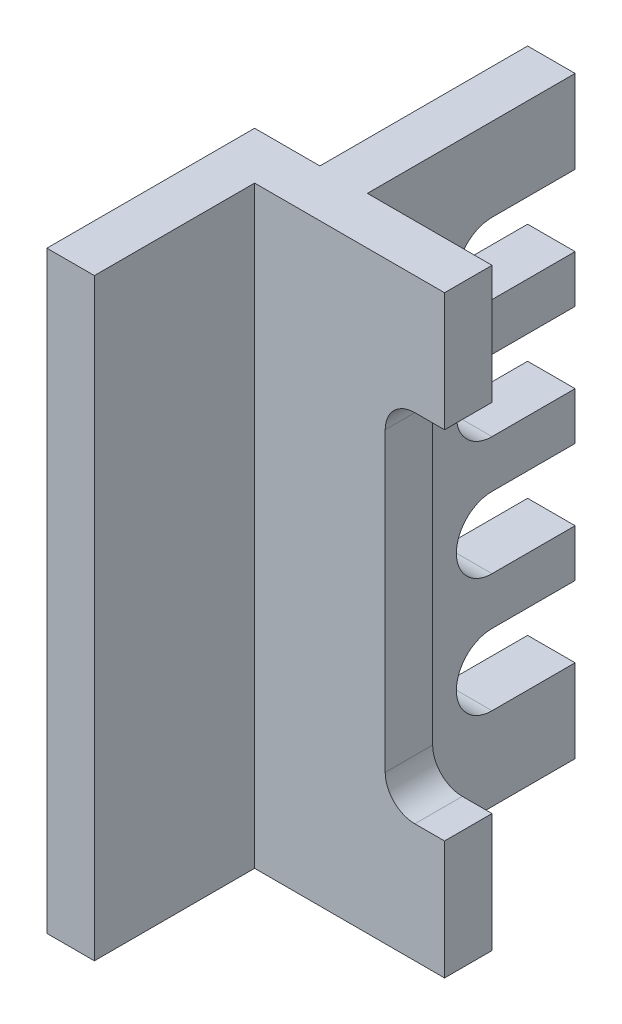
ISO-10303-21;
HEADER;
FILE_DESCRIPTION(('STEP AP214'),'2;1');
FILE_NAME('part.step','',(''),(''),'','','');
FILE_SCHEMA(('AUTOMOTIVE_DESIGN { 1 0 10303 214 1 1 1 1 }'));
ENDSEC;
DATA;
#1=APPLICATION_CONTEXT('core data for automotive mechanical design processes');
#2=APPLICATION_PROTOCOL_DEFINITION('international standard','automotive_design',2000,#1);
#3=PRODUCT_CONTEXT('',#1,'mechanical');
#4=PRODUCT('Part','Part','',(#3));
#5=PRODUCT_RELATED_PRODUCT_CATEGORY('part','',(#4));
#6=PRODUCT_DEFINITION_FORMATION('','',#4);
#7=PRODUCT_DEFINITION_CONTEXT('part definition',#1,'design');
#8=PRODUCT_DEFINITION('design','',#6,#7);
#9=PRODUCT_DEFINITION_SHAPE('','',#8);
#10=(LENGTH_UNIT() NAMED_UNIT(*) SI_UNIT(.MILLI.,.METRE.));
#11=(NAMED_UNIT(*) PLANE_ANGLE_UNIT() SI_UNIT($,.RADIAN.));
#12=(NAMED_UNIT(*) SI_UNIT($,.STERADIAN.) SOLID_ANGLE_UNIT());
#13=UNCERTAINTY_MEASURE_WITH_UNIT(LENGTH_MEASURE(1.E-05),#10,'distance_accuracy_value','');
#14=(GEOMETRIC_REPRESENTATION_CONTEXT(3) GLOBAL_UNCERTAINTY_ASSIGNED_CONTEXT((#13)) GLOBAL_UNIT_ASSIGNED_CONTEXT((#10,
#11,#12)) REPRESENTATION_CONTEXT('',''));
#15=CARTESIAN_POINT('',(0.,0.,0.));
#16=DIRECTION('',(0.,0.,1.));
#17=DIRECTION('',(1.,0.,0.));
#18=AXIS2_PLACEMENT_3D('',#15,#16,#17);
#19=CARTESIAN_POINT('',(0.,0.,-70.));
#20=DIRECTION('',(0.,0.,-1.));
#21=DIRECTION('',(-1.,0.,0.));
#22=AXIS2_PLACEMENT_3D('',#19,#20,#21);
#23=PLANE('',#22);
#24=DIRECTION('',(1.,0.,0.));
#25=VECTOR('',#24,1.);
#26=CARTESIAN_POINT('',(11.,86.,-70.));
#27=LINE('',#26,#25);
#28=CARTESIAN_POINT('',(11.,86.,-70.));
#29=VERTEX_POINT('',#28);
#30=CARTESIAN_POINT('',(19.,86.,-70.));
#31=VERTEX_POINT('',#30);
#32=EDGE_CURVE('E293',#29,#31,#27,.T.);
#33=ORIENTED_EDGE('',*,*,#32,.F.);
#34=DIRECTION('',(0.,1.,0.));
#35=VECTOR('',#34,1.);
#36=CARTESIAN_POINT('',(11.,0.,-70.));
#37=LINE('',#36,#35);
#38=CARTESIAN_POINT('',(11.,100.,-70.));
#39=VERTEX_POINT('',#38);
#40=EDGE_CURVE('E415',#29,#39,#37,.T.);
#41=ORIENTED_EDGE('',*,*,#40,.T.);
#42=DIRECTION('',(1.,0.,0.));
#43=VECTOR('',#42,1.);
#44=CARTESIAN_POINT('',(11.,100.,-70.));
#45=LINE('',#44,#43);
#46=CARTESIAN_POINT('',(19.,100.,-70.));
#47=VERTEX_POINT('',#46);
#48=EDGE_CURVE('E401',#39,#47,#45,.T.);
#49=ORIENTED_EDGE('',*,*,#48,.T.);
#50=DIRECTION('',(0.,-1.,0.));
#51=VECTOR('',#50,1.);
#52=CARTESIAN_POINT('',(19.,100.,-70.));
#53=LINE('',#52,#51);
#54=EDGE_CURVE('E407',#47,#31,#53,.T.);
#55=ORIENTED_EDGE('',*,*,#54,.T.);
#56=EDGE_LOOP('',(#33,#41,#49,#55));
#57=FACE_BOUND('',#56,.T.);
#58=ADVANCED_FACE('F39',(#57),#23,.T.);
#59=DIRECTION('',(1.,0.,0.));
#60=VECTOR('',#59,1.);
#61=CARTESIAN_POINT('',(11.,74.,-70.));
#62=LINE('',#61,#60);
#63=CARTESIAN_POINT('',(11.,74.,-70.));
#64=VERTEX_POINT('',#63);
#65=CARTESIAN_POINT('',(19.,74.,-70.));
#66=VERTEX_POINT('',#65);
#67=EDGE_CURVE('E260',#64,#66,#62,.T.);
#68=ORIENTED_EDGE('',*,*,#67,.T.);
#69=CARTESIAN_POINT('',(19.,66.,-70.0000000000002));
#70=VERTEX_POINT('',#69);
#71=EDGE_CURVE('E412',#66,#70,#53,.T.);
#72=ORIENTED_EDGE('',*,*,#71,.T.);
#73=DIRECTION('',(1.,0.,0.));
#74=VECTOR('',#73,1.);
#75=CARTESIAN_POINT('',(11.,66.,-70.0000000000002));
#76=LINE('',#75,#74);
#77=CARTESIAN_POINT('',(11.,66.,-70.0000000000002));
#78=VERTEX_POINT('',#77);
#79=EDGE_CURVE('E325',#78,#70,#76,.T.);
#80=ORIENTED_EDGE('',*,*,#79,.F.);
#81=EDGE_CURVE('E612',#78,#64,#37,.T.);
#82=ORIENTED_EDGE('',*,*,#81,.T.);
#83=EDGE_LOOP('',(#68,#72,#80,#82));
#84=FACE_BOUND('',#83,.T.);
#85=ADVANCED_FACE('F649',(#84),#23,.T.);
#86=DIRECTION('',(1.,0.,0.));
#87=VECTOR('',#86,1.);
#88=CARTESIAN_POINT('',(11.,54.,-70.0000000000002));
#89=LINE('',#88,#87);
#90=CARTESIAN_POINT('',(11.,54.,-70.0000000000002));
#91=VERTEX_POINT('',#90);
#92=CARTESIAN_POINT('',(19.,54.,-70.));
#93=VERTEX_POINT('',#92);
#94=EDGE_CURVE('E328',#91,#93,#89,.T.);
#95=ORIENTED_EDGE('',*,*,#94,.T.);
#96=CARTESIAN_POINT('',(19.,46.,-70.0000000000004));
#97=VERTEX_POINT('',#96);
#98=EDGE_CURVE('E641',#93,#97,#53,.T.);
#99=ORIENTED_EDGE('',*,*,#98,.T.);
#100=DIRECTION('',(1.,0.,0.));
#101=VECTOR('',#100,1.);
#102=CARTESIAN_POINT('',(11.,46.,-70.0000000000004));
#103=LINE('',#102,#101);
#104=CARTESIAN_POINT('',(11.,46.,-70.0000000000004));
#105=VERTEX_POINT('',#104);
#106=EDGE_CURVE('E360',#105,#97,#103,.T.);
#107=ORIENTED_EDGE('',*,*,#106,.F.);
#108=EDGE_CURVE('E614',#105,#91,#37,.T.);
#109=ORIENTED_EDGE('',*,*,#108,.T.);
#110=EDGE_LOOP('',(#95,#99,#107,#109));
#111=FACE_BOUND('',#110,.T.);
#112=ADVANCED_FACE('F661',(#111),#23,.T.);
#113=DIRECTION('',(1.,0.,0.));
#114=VECTOR('',#113,1.);
#115=CARTESIAN_POINT('',(11.,34.,-70.0000000000004));
#116=LINE('',#115,#114);
#117=CARTESIAN_POINT('',(11.,34.,-70.0000000000004));
#118=VERTEX_POINT('',#117);
#119=CARTESIAN_POINT('',(19.,34.,-70.));
#120=VERTEX_POINT('',#119);
#121=EDGE_CURVE('E363',#118,#120,#116,.T.);
#122=ORIENTED_EDGE('',*,*,#121,.T.);
#123=CARTESIAN_POINT('',(19.,26.,-70.0000000000006));
#124=VERTEX_POINT('',#123);
#125=EDGE_CURVE('E638',#120,#124,#53,.T.);
#126=ORIENTED_EDGE('',*,*,#125,.T.);
#127=DIRECTION('',(1.,0.,0.));
#128=VECTOR('',#127,1.);
#129=CARTESIAN_POINT('',(11.,26.,-70.0000000000006));
#130=LINE('',#129,#128);
#131=CARTESIAN_POINT('',(11.,26.,-70.0000000000006));
#132=VERTEX_POINT('',#131);
#133=EDGE_CURVE('E393',#132,#124,#130,.T.);
#134=ORIENTED_EDGE('',*,*,#133,.F.);
#135=EDGE_CURVE('E421',#132,#118,#37,.T.);
#136=ORIENTED_EDGE('',*,*,#135,.T.);
#137=EDGE_LOOP('',(#122,#126,#134,#136));
#138=FACE_BOUND('',#137,.T.);
#139=ADVANCED_FACE('F627',(#138),#23,.T.);
#140=CARTESIAN_POINT('',(40.,100.,-35.));
#141=DIRECTION('',(0.,0.,1.));
#142=DIRECTION('',(1.,0.,0.));
#143=AXIS2_PLACEMENT_3D('',#140,#141,#142);
#144=PLANE('',#143);
#145=DIRECTION('',(0.,1.,0.));
#146=VECTOR('',#145,1.);
#147=CARTESIAN_POINT('',(11.,0.,-35.));
#148=LINE('',#147,#146);
#149=CARTESIAN_POINT('',(11.,0.,-35.));
#150=VERTEX_POINT('',#149);
#151=CARTESIAN_POINT('',(11.,100.,-35.));
#152=VERTEX_POINT('',#151);
#153=EDGE_CURVE('E406',#150,#152,#148,.T.);
#154=ORIENTED_EDGE('',*,*,#153,.F.);
#155=DIRECTION('',(-1.,0.,0.));
#156=VECTOR('',#155,1.);
#157=CARTESIAN_POINT('',(40.,0.,-35.));
#158=LINE('',#157,#156);
#159=CARTESIAN_POINT('',(0.,0.,-35.));
#160=VERTEX_POINT('',#159);
#161=EDGE_CURVE('E542',#150,#160,#158,.T.);
#162=ORIENTED_EDGE('',*,*,#161,.T.);
#163=DIRECTION('',(0.,-1.,0.));
#164=VECTOR('',#163,1.);
#165=CARTESIAN_POINT('',(0.,100.,-35.));
#166=LINE('',#165,#164);
#167=CARTESIAN_POINT('',(0.,100.,-35.));
#168=VERTEX_POINT('',#167);
#169=EDGE_CURVE('E524',#168,#160,#166,.T.);
#170=ORIENTED_EDGE('',*,*,#169,.F.);
#171=DIRECTION('',(-1.,0.,0.));
#172=VECTOR('',#171,1.);
#173=CARTESIAN_POINT('',(40.,100.,-35.));
#174=LINE('',#173,#172);
#175=EDGE_CURVE('E519',#152,#168,#174,.T.);
#176=ORIENTED_EDGE('',*,*,#175,.F.);
#177=EDGE_LOOP('',(#154,#162,#170,#176));
#178=FACE_BOUND('',#177,.T.);
#179=ADVANCED_FACE('F690',(#178),#144,.F.);
#180=DIRECTION('',(0.,-1.,0.));
#181=VECTOR('',#180,1.);
#182=CARTESIAN_POINT('',(19.,100.,-35.));
#183=LINE('',#182,#181);
#184=CARTESIAN_POINT('',(19.,100.,-35.));
#185=VERTEX_POINT('',#184);
#186=CARTESIAN_POINT('',(19.,0.,-35.));
#187=VERTEX_POINT('',#186);
#188=EDGE_CURVE('E292',#185,#187,#183,.T.);
#189=ORIENTED_EDGE('',*,*,#188,.F.);
#190=CARTESIAN_POINT('',(40.,100.,-35.));
#191=VERTEX_POINT('',#190);
#192=EDGE_CURVE('E520',#191,#185,#174,.T.);
#193=ORIENTED_EDGE('',*,*,#192,.F.);
#194=DIRECTION('',(0.,-1.,0.));
#195=VECTOR('',#194,1.);
#196=CARTESIAN_POINT('',(40.,100.,-35.));
#197=LINE('',#196,#195);
#198=CARTESIAN_POINT('',(40.,80.,-35.));
#199=VERTEX_POINT('',#198);
#200=EDGE_CURVE('E549',#191,#199,#197,.T.);
#201=ORIENTED_EDGE('',*,*,#200,.T.);
#202=DIRECTION('',(1.,0.,0.));
#203=VECTOR('',#202,1.);
#204=CARTESIAN_POINT('',(35.,80.,-35.));
#205=LINE('',#204,#203);
#206=CARTESIAN_POINT('',(35.,80.,-35.));
#207=VERTEX_POINT('',#206);
#208=EDGE_CURVE('E449',#207,#199,#205,.T.);
#209=ORIENTED_EDGE('',*,*,#208,.F.);
#210=CARTESIAN_POINT('',(35.,75.,-35.));
#211=DIRECTION('',(0.,0.,-1.));
#212=DIRECTION('',(1.,0.,0.));
#213=AXIS2_PLACEMENT_3D('',#210,#211,#212);
#214=CIRCLE('',#213,5.);
#215=CARTESIAN_POINT('',(30.,75.,-35.));
#216=VERTEX_POINT('',#215);
#217=EDGE_CURVE('E477',#216,#207,#214,.T.);
#218=ORIENTED_EDGE('',*,*,#217,.F.);
#219=DIRECTION('',(0.,1.,0.));
#220=VECTOR('',#219,1.);
#221=CARTESIAN_POINT('',(30.,25.,-35.));
#222=LINE('',#221,#220);
#223=CARTESIAN_POINT('',(30.,25.,-35.));
#224=VERTEX_POINT('',#223);
#225=EDGE_CURVE('E473',#224,#216,#222,.T.);
#226=ORIENTED_EDGE('',*,*,#225,.F.);
#227=CARTESIAN_POINT('',(35.,25.,-35.));
#228=DIRECTION('',(0.,0.,-1.));
#229=DIRECTION('',(-1.,0.,0.));
#230=AXIS2_PLACEMENT_3D('',#227,#228,#229);
#231=CIRCLE('',#230,5.);
#232=CARTESIAN_POINT('',(35.,20.,-35.));
#233=VERTEX_POINT('',#232);
#234=EDGE_CURVE('E469',#233,#224,#231,.T.);
#235=ORIENTED_EDGE('',*,*,#234,.F.);
#236=DIRECTION('',(-1.,0.,0.));
#237=VECTOR('',#236,1.);
#238=CARTESIAN_POINT('',(40.,20.,-35.));
#239=LINE('',#238,#237);
#240=CARTESIAN_POINT('',(40.,20.,-35.));
#241=VERTEX_POINT('',#240);
#242=EDGE_CURVE('E443',#241,#233,#239,.T.);
#243=ORIENTED_EDGE('',*,*,#242,.F.);
#244=CARTESIAN_POINT('',(40.,0.,-35.));
#245=VERTEX_POINT('',#244);
#246=EDGE_CURVE('E548',#241,#245,#197,.T.);
#247=ORIENTED_EDGE('',*,*,#246,.T.);
#248=EDGE_CURVE('E507',#245,#187,#158,.T.);
#249=ORIENTED_EDGE('',*,*,#248,.T.);
#250=EDGE_LOOP('',(#189,#193,#201,#209,#218,#226,#235,#243,#247,#249));
#251=FACE_BOUND('',#250,.T.);
#252=ADVANCED_FACE('F607',(#251),#144,.F.);
#253=CARTESIAN_POINT('',(40.,100.,-27.));
#254=DIRECTION('',(-1.,0.,0.));
#255=DIRECTION('',(0.,0.,1.));
#256=AXIS2_PLACEMENT_3D('',#253,#254,#255);
#257=PLANE('',#256);
#258=DIRECTION('',(0.,-1.,0.));
#259=VECTOR('',#258,1.);
#260=CARTESIAN_POINT('',(40.,100.,-27.));
#261=LINE('',#260,#259);
#262=CARTESIAN_POINT('',(40.,100.,-27.));
#263=VERTEX_POINT('',#262);
#264=CARTESIAN_POINT('',(40.,80.,-27.));
#265=VERTEX_POINT('',#264);
#266=EDGE_CURVE('E554',#263,#265,#261,.T.);
#267=ORIENTED_EDGE('',*,*,#266,.T.);
#268=DIRECTION('',(0.,0.,-1.));
#269=VECTOR('',#268,1.);
#270=CARTESIAN_POINT('',(40.,80.,-27.));
#271=LINE('',#270,#269);
#272=EDGE_CURVE('E483',#265,#199,#271,.T.);
#273=ORIENTED_EDGE('',*,*,#272,.T.);
#274=ORIENTED_EDGE('',*,*,#200,.F.);
#275=DIRECTION('',(0.,0.,-1.));
#276=VECTOR('',#275,1.);
#277=CARTESIAN_POINT('',(40.,100.,-27.));
#278=LINE('',#277,#276);
#279=EDGE_CURVE('E516',#263,#191,#278,.T.);
#280=ORIENTED_EDGE('',*,*,#279,.F.);
#281=EDGE_LOOP('',(#267,#273,#274,#280));
#282=FACE_BOUND('',#281,.T.);
#283=ADVANCED_FACE('F740',(#282),#257,.F.);
#284=CARTESIAN_POINT('',(0.,100.,-35.));
#285=DIRECTION('',(1.,0.,0.));
#286=DIRECTION('',(0.,0.,-1.));
#287=AXIS2_PLACEMENT_3D('',#284,#285,#286);
#288=PLANE('',#287);
#289=DIRECTION('',(0.,0.,1.));
#290=VECTOR('',#289,1.);
#291=CARTESIAN_POINT('',(0.,0.,-35.));
#292=LINE('',#291,#290);
#293=CARTESIAN_POINT('',(0.,0.,0.));
#294=VERTEX_POINT('',#293);
#295=EDGE_CURVE('E487',#160,#294,#292,.T.);
#296=ORIENTED_EDGE('',*,*,#295,.T.);
#297=DIRECTION('',(0.,-1.,0.));
#298=VECTOR('',#297,1.);
#299=CARTESIAN_POINT('',(0.,100.,0.));
#300=LINE('',#299,#298);
#301=CARTESIAN_POINT('',(0.,100.,0.));
#302=VERTEX_POINT('',#301);
#303=EDGE_CURVE('E11',#302,#294,#300,.T.);
#304=ORIENTED_EDGE('',*,*,#303,.F.);
#305=DIRECTION('',(0.,0.,1.));
#306=VECTOR('',#305,1.);
#307=CARTESIAN_POINT('',(0.,100.,-35.));
#308=LINE('',#307,#306);
#309=EDGE_CURVE('E502',#168,#302,#308,.T.);
#310=ORIENTED_EDGE('',*,*,#309,.F.);
#311=ORIENTED_EDGE('',*,*,#169,.T.);
#312=EDGE_LOOP('',(#296,#304,#310,#311));
#313=FACE_BOUND('',#312,.T.);
#314=ADVANCED_FACE('F41',(#313),#288,.F.);
#315=CARTESIAN_POINT('',(0.,100.,0.));
#316=DIRECTION('',(0.,0.,-1.));
#317=DIRECTION('',(-1.,0.,0.));
#318=AXIS2_PLACEMENT_3D('',#315,#316,#317);
#319=PLANE('',#318);
#320=DIRECTION('',(1.,0.,0.));
#321=VECTOR('',#320,1.);
#322=CARTESIAN_POINT('',(0.,0.,0.));
#323=LINE('',#322,#321);
#324=CARTESIAN_POINT('',(8.,0.,0.));
#325=VERTEX_POINT('',#324);
#326=EDGE_CURVE('E528',#294,#325,#323,.T.);
#327=ORIENTED_EDGE('',*,*,#326,.T.);
#328=DIRECTION('',(0.,-1.,0.));
#329=VECTOR('',#328,1.);
#330=CARTESIAN_POINT('',(8.,100.,0.));
#331=LINE('',#330,#329);
#332=CARTESIAN_POINT('',(8.,100.,0.));
#333=VERTEX_POINT('',#332);
#334=EDGE_CURVE('E48',#333,#325,#331,.T.);
#335=ORIENTED_EDGE('',*,*,#334,.F.);
#336=DIRECTION('',(1.,0.,0.));
#337=VECTOR('',#336,1.);
#338=CARTESIAN_POINT('',(0.,100.,0.));
#339=LINE('',#338,#337);
#340=EDGE_CURVE('E506',#302,#333,#339,.T.);
#341=ORIENTED_EDGE('',*,*,#340,.F.);
#342=ORIENTED_EDGE('',*,*,#303,.T.);
#343=EDGE_LOOP('',(#327,#335,#341,#342));
#344=FACE_BOUND('',#343,.T.);
#345=ADVANCED_FACE('F587',(#344),#319,.F.);
#346=CARTESIAN_POINT('',(8.,100.,0.));
#347=DIRECTION('',(-1.,0.,0.));
#348=DIRECTION('',(0.,0.,1.));
#349=AXIS2_PLACEMENT_3D('',#346,#347,#348);
#350=PLANE('',#349);
#351=DIRECTION('',(0.,0.,-1.));
#352=VECTOR('',#351,1.);
#353=CARTESIAN_POINT('',(8.,0.,0.));
#354=LINE('',#353,#352);
#355=CARTESIAN_POINT('',(8.,0.,-27.));
#356=VERTEX_POINT('',#355);
#357=EDGE_CURVE('E531',#325,#356,#354,.T.);
#358=ORIENTED_EDGE('',*,*,#357,.T.);
#359=DIRECTION('',(0.,-1.,0.));
#360=VECTOR('',#359,1.);
#361=CARTESIAN_POINT('',(8.,100.,-27.));
#362=LINE('',#361,#360);
#363=CARTESIAN_POINT('',(8.,100.,-27.));
#364=VERTEX_POINT('',#363);
#365=EDGE_CURVE('E558',#364,#356,#362,.T.);
#366=ORIENTED_EDGE('',*,*,#365,.F.);
#367=DIRECTION('',(0.,0.,-1.));
#368=VECTOR('',#367,1.);
#369=CARTESIAN_POINT('',(8.,100.,0.));
#370=LINE('',#369,#368);
#371=EDGE_CURVE('E510',#333,#364,#370,.T.);
#372=ORIENTED_EDGE('',*,*,#371,.F.);
#373=ORIENTED_EDGE('',*,*,#334,.T.);
#374=EDGE_LOOP('',(#358,#366,#372,#373));
#375=FACE_BOUND('',#374,.T.);
#376=ADVANCED_FACE('F567',(#375),#350,.F.);
#377=CARTESIAN_POINT('',(8.,100.,-27.));
#378=DIRECTION('',(0.,0.,-1.));
#379=DIRECTION('',(-1.,0.,0.));
#380=AXIS2_PLACEMENT_3D('',#377,#378,#379);
#381=PLANE('',#380);
#382=CARTESIAN_POINT('',(35.,75.,-27.));
#383=DIRECTION('',(0.,0.,-1.));
#384=DIRECTION('',(1.,0.,0.));
#385=AXIS2_PLACEMENT_3D('',#382,#383,#384);
#386=CIRCLE('',#385,5.);
#387=CARTESIAN_POINT('',(30.,75.,-27.));
#388=VERTEX_POINT('',#387);
#389=CARTESIAN_POINT('',(35.,80.,-27.));
#390=VERTEX_POINT('',#389);
#391=EDGE_CURVE('E457',#388,#390,#386,.T.);
#392=ORIENTED_EDGE('',*,*,#391,.T.);
#393=DIRECTION('',(1.,0.,0.));
#394=VECTOR('',#393,1.);
#395=CARTESIAN_POINT('',(35.,80.,-27.));
#396=LINE('',#395,#394);
#397=EDGE_CURVE('E461',#390,#265,#396,.T.);
#398=ORIENTED_EDGE('',*,*,#397,.T.);
#399=ORIENTED_EDGE('',*,*,#266,.F.);
#400=DIRECTION('',(1.,0.,0.));
#401=VECTOR('',#400,1.);
#402=CARTESIAN_POINT('',(8.,100.,-27.));
#403=LINE('',#402,#401);
#404=EDGE_CURVE('E513',#364,#263,#403,.T.);
#405=ORIENTED_EDGE('',*,*,#404,.F.);
#406=ORIENTED_EDGE('',*,*,#365,.T.);
#407=DIRECTION('',(1.,0.,0.));
#408=VECTOR('',#407,1.);
#409=CARTESIAN_POINT('',(8.,0.,-27.));
#410=LINE('',#409,#408);
#411=CARTESIAN_POINT('',(40.,0.,-27.));
#412=VERTEX_POINT('',#411);
#413=EDGE_CURVE('E534',#356,#412,#410,.T.);
#414=ORIENTED_EDGE('',*,*,#413,.T.);
#415=CARTESIAN_POINT('',(40.,20.,-27.));
#416=VERTEX_POINT('',#415);
#417=EDGE_CURVE('E553',#416,#412,#261,.T.);
#418=ORIENTED_EDGE('',*,*,#417,.F.);
#419=DIRECTION('',(-1.,0.,0.));
#420=VECTOR('',#419,1.);
#421=CARTESIAN_POINT('',(40.,20.,-27.));
#422=LINE('',#421,#420);
#423=CARTESIAN_POINT('',(35.,20.,-27.));
#424=VERTEX_POINT('',#423);
#425=EDGE_CURVE('E444',#416,#424,#422,.T.);
#426=ORIENTED_EDGE('',*,*,#425,.T.);
#427=CARTESIAN_POINT('',(35.,25.,-27.));
#428=DIRECTION('',(0.,0.,-1.));
#429=DIRECTION('',(-1.,0.,0.));
#430=AXIS2_PLACEMENT_3D('',#427,#428,#429);
#431=CIRCLE('',#430,5.);
#432=CARTESIAN_POINT('',(30.,25.,-27.));
#433=VERTEX_POINT('',#432);
#434=EDGE_CURVE('E448',#424,#433,#431,.T.);
#435=ORIENTED_EDGE('',*,*,#434,.T.);
#436=DIRECTION('',(0.,1.,0.));
#437=VECTOR('',#436,1.);
#438=CARTESIAN_POINT('',(30.,25.,-27.));
#439=LINE('',#438,#437);
#440=EDGE_CURVE('E453',#433,#388,#439,.T.);
#441=ORIENTED_EDGE('',*,*,#440,.T.);
#442=EDGE_LOOP('',(#392,#398,#399,#405,#406,#414,#418,#426,#435,#441));
#443=FACE_BOUND('',#442,.T.);
#444=ADVANCED_FACE('F578',(#443),#381,.F.);
#445=ORIENTED_EDGE('',*,*,#246,.F.);
#446=DIRECTION('',(0.,0.,-1.));
#447=VECTOR('',#446,1.);
#448=CARTESIAN_POINT('',(40.,20.,-27.));
#449=LINE('',#448,#447);
#450=EDGE_CURVE('E465',#416,#241,#449,.T.);
#451=ORIENTED_EDGE('',*,*,#450,.F.);
#452=ORIENTED_EDGE('',*,*,#417,.T.);
#453=DIRECTION('',(0.,0.,-1.));
#454=VECTOR('',#453,1.);
#455=CARTESIAN_POINT('',(40.,0.,-27.));
#456=LINE('',#455,#454);
#457=EDGE_CURVE('E538',#412,#245,#456,.T.);
#458=ORIENTED_EDGE('',*,*,#457,.T.);
#459=EDGE_LOOP('',(#445,#451,#452,#458));
#460=FACE_BOUND('',#459,.T.);
#461=ADVANCED_FACE('F728',(#460),#257,.F.);
#462=CARTESIAN_POINT('',(0.,100.,0.));
#463=DIRECTION('',(0.,1.,0.));
#464=DIRECTION('',(0.,0.,1.));
#465=AXIS2_PLACEMENT_3D('',#462,#463,#464);
#466=PLANE('',#465);
#467=ORIENTED_EDGE('',*,*,#309,.T.);
#468=ORIENTED_EDGE('',*,*,#340,.T.);
#469=ORIENTED_EDGE('',*,*,#371,.T.);
#470=ORIENTED_EDGE('',*,*,#404,.T.);
#471=ORIENTED_EDGE('',*,*,#279,.T.);
#472=ORIENTED_EDGE('',*,*,#192,.T.);
#473=DIRECTION('',(0.,0.,1.));
#474=VECTOR('',#473,1.);
#475=CARTESIAN_POINT('',(19.,100.,-70.));
#476=LINE('',#475,#474);
#477=EDGE_CURVE('E439',#47,#185,#476,.T.);
#478=ORIENTED_EDGE('',*,*,#477,.F.);
#479=ORIENTED_EDGE('',*,*,#48,.F.);
#480=DIRECTION('',(0.,0.,1.));
#481=VECTOR('',#480,1.);
#482=CARTESIAN_POINT('',(11.,100.,-70.));
#483=LINE('',#482,#481);
#484=EDGE_CURVE('E420',#39,#152,#483,.T.);
#485=ORIENTED_EDGE('',*,*,#484,.T.);
#486=ORIENTED_EDGE('',*,*,#175,.T.);
#487=EDGE_LOOP('',(#467,#468,#469,#470,#471,#472,#478,#479,#485,#486));
#488=FACE_BOUND('',#487,.T.);
#489=ADVANCED_FACE('F583',(#488),#466,.T.);
#490=CARTESIAN_POINT('',(0.,0.,0.));
#491=DIRECTION('',(0.,1.,0.));
#492=DIRECTION('',(0.,0.,1.));
#493=AXIS2_PLACEMENT_3D('',#490,#491,#492);
#494=PLANE('',#493);
#495=ORIENTED_EDGE('',*,*,#295,.F.);
#496=ORIENTED_EDGE('',*,*,#161,.F.);
#497=DIRECTION('',(0.,0.,1.));
#498=VECTOR('',#497,1.);
#499=CARTESIAN_POINT('',(11.,0.,-70.));
#500=LINE('',#499,#498);
#501=CARTESIAN_POINT('',(11.,0.,-70.));
#502=VERTEX_POINT('',#501);
#503=EDGE_CURVE('E431',#502,#150,#500,.T.);
#504=ORIENTED_EDGE('',*,*,#503,.F.);
#505=DIRECTION('',(-1.,0.,0.));
#506=VECTOR('',#505,1.);
#507=CARTESIAN_POINT('',(19.,0.,-70.));
#508=LINE('',#507,#506);
#509=CARTESIAN_POINT('',(19.,0.,-70.));
#510=VERTEX_POINT('',#509);
#511=EDGE_CURVE('E411',#510,#502,#508,.T.);
#512=ORIENTED_EDGE('',*,*,#511,.F.);
#513=DIRECTION('',(0.,0.,1.));
#514=VECTOR('',#513,1.);
#515=CARTESIAN_POINT('',(19.,0.,-70.));
#516=LINE('',#515,#514);
#517=EDGE_CURVE('E435',#510,#187,#516,.T.);
#518=ORIENTED_EDGE('',*,*,#517,.T.);
#519=ORIENTED_EDGE('',*,*,#248,.F.);
#520=ORIENTED_EDGE('',*,*,#457,.F.);
#521=ORIENTED_EDGE('',*,*,#413,.F.);
#522=ORIENTED_EDGE('',*,*,#357,.F.);
#523=ORIENTED_EDGE('',*,*,#326,.F.);
#524=EDGE_LOOP('',(#495,#496,#504,#512,#518,#519,#520,#521,#522,#523));
#525=FACE_BOUND('',#524,.T.);
#526=ADVANCED_FACE('F573',(#525),#494,.F.);
#527=CARTESIAN_POINT('',(35.,80.,-27.));
#528=DIRECTION('',(0.,1.,0.));
#529=DIRECTION('',(0.,0.,1.));
#530=AXIS2_PLACEMENT_3D('',#527,#528,#529);
#531=PLANE('',#530);
#532=ORIENTED_EDGE('',*,*,#208,.T.);
#533=ORIENTED_EDGE('',*,*,#272,.F.);
#534=ORIENTED_EDGE('',*,*,#397,.F.);
#535=DIRECTION('',(0.,0.,-1.));
#536=VECTOR('',#535,1.);
#537=CARTESIAN_POINT('',(35.,80.,-27.));
#538=LINE('',#537,#536);
#539=EDGE_CURVE('E488',#390,#207,#538,.T.);
#540=ORIENTED_EDGE('',*,*,#539,.T.);
#541=EDGE_LOOP('',(#532,#533,#534,#540));
#542=FACE_BOUND('',#541,.T.);
#543=ADVANCED_FACE('F716',(#542),#531,.F.);
#544=CARTESIAN_POINT('',(35.,75.,-27.));
#545=DIRECTION('',(0.,0.,-1.));
#546=DIRECTION('',(-1.,0.,0.));
#547=AXIS2_PLACEMENT_3D('',#544,#545,#546);
#548=CYLINDRICAL_SURFACE('',#547,5.);
#549=ORIENTED_EDGE('',*,*,#217,.T.);
#550=ORIENTED_EDGE('',*,*,#539,.F.);
#551=ORIENTED_EDGE('',*,*,#391,.F.);
#552=DIRECTION('',(0.,0.,-1.));
#553=VECTOR('',#552,1.);
#554=CARTESIAN_POINT('',(30.,75.,-27.));
#555=LINE('',#554,#553);
#556=EDGE_CURVE('E491',#388,#216,#555,.T.);
#557=ORIENTED_EDGE('',*,*,#556,.T.);
#558=EDGE_LOOP('',(#549,#550,#551,#557));
#559=FACE_BOUND('',#558,.T.);
#560=ADVANCED_FACE('F776',(#559),#548,.F.);
#561=CARTESIAN_POINT('',(30.,25.,-27.));
#562=DIRECTION('',(-1.,0.,0.));
#563=DIRECTION('',(0.,0.,1.));
#564=AXIS2_PLACEMENT_3D('',#561,#562,#563);
#565=PLANE('',#564);
#566=ORIENTED_EDGE('',*,*,#225,.T.);
#567=ORIENTED_EDGE('',*,*,#556,.F.);
#568=ORIENTED_EDGE('',*,*,#440,.F.);
#569=DIRECTION('',(0.,0.,-1.));
#570=VECTOR('',#569,1.);
#571=CARTESIAN_POINT('',(30.,25.,-27.));
#572=LINE('',#571,#570);
#573=EDGE_CURVE('E494',#433,#224,#572,.T.);
#574=ORIENTED_EDGE('',*,*,#573,.T.);
#575=EDGE_LOOP('',(#566,#567,#568,#574));
#576=FACE_BOUND('',#575,.T.);
#577=ADVANCED_FACE('F766',(#576),#565,.F.);
#578=CARTESIAN_POINT('',(35.,25.,-27.));
#579=DIRECTION('',(0.,0.,-1.));
#580=DIRECTION('',(-1.,0.,0.));
#581=AXIS2_PLACEMENT_3D('',#578,#579,#580);
#582=CYLINDRICAL_SURFACE('',#581,5.);
#583=ORIENTED_EDGE('',*,*,#234,.T.);
#584=ORIENTED_EDGE('',*,*,#573,.F.);
#585=ORIENTED_EDGE('',*,*,#434,.F.);
#586=DIRECTION('',(0.,0.,-1.));
#587=VECTOR('',#586,1.);
#588=CARTESIAN_POINT('',(35.,20.,-27.));
#589=LINE('',#588,#587);
#590=EDGE_CURVE('E497',#424,#233,#589,.T.);
#591=ORIENTED_EDGE('',*,*,#590,.T.);
#592=EDGE_LOOP('',(#583,#584,#585,#591));
#593=FACE_BOUND('',#592,.T.);
#594=ADVANCED_FACE('F755',(#593),#582,.F.);
#595=CARTESIAN_POINT('',(40.,20.,-27.));
#596=DIRECTION('',(0.,-1.,0.));
#597=DIRECTION('',(0.,0.,-1.));
#598=AXIS2_PLACEMENT_3D('',#595,#596,#597);
#599=PLANE('',#598);
#600=ORIENTED_EDGE('',*,*,#242,.T.);
#601=ORIENTED_EDGE('',*,*,#590,.F.);
#602=ORIENTED_EDGE('',*,*,#425,.F.);
#603=ORIENTED_EDGE('',*,*,#450,.T.);
#604=EDGE_LOOP('',(#600,#601,#602,#603));
#605=FACE_BOUND('',#604,.T.);
#606=ADVANCED_FACE('F751',(#605),#599,.F.);
#607=CARTESIAN_POINT('',(19.,100.,-70.));
#608=DIRECTION('',(-1.,0.,0.));
#609=DIRECTION('',(0.,-1.,0.));
#610=AXIS2_PLACEMENT_3D('',#607,#608,#609);
#611=PLANE('',#610);
#612=CARTESIAN_POINT('',(19.,80.,-56.));
#613=DIRECTION('',(1.,0.,0.));
#614=DIRECTION('',(0.,1.,0.));
#615=AXIS2_PLACEMENT_3D('',#612,#613,#614);
#616=CIRCLE('',#615,6.00000000000001);
#617=CARTESIAN_POINT('',(19.,86.,-56.));
#618=VERTEX_POINT('',#617);
#619=CARTESIAN_POINT('',(19.,74.,-56.));
#620=VERTEX_POINT('',#619);
#621=EDGE_CURVE('E256',#618,#620,#616,.T.);
#622=ORIENTED_EDGE('',*,*,#621,.F.);
#623=DIRECTION('',(0.,0.,1.));
#624=VECTOR('',#623,1.);
#625=CARTESIAN_POINT('',(19.,86.,-56.));
#626=LINE('',#625,#624);
#627=EDGE_CURVE('E275',#31,#618,#626,.T.);
#628=ORIENTED_EDGE('',*,*,#627,.F.);
#629=ORIENTED_EDGE('',*,*,#54,.F.);
#630=ORIENTED_EDGE('',*,*,#477,.T.);
#631=ORIENTED_EDGE('',*,*,#188,.T.);
#632=ORIENTED_EDGE('',*,*,#517,.F.);
#633=CARTESIAN_POINT('',(19.,14.,-70.));
#634=VERTEX_POINT('',#633);
#635=EDGE_CURVE('E405',#634,#510,#53,.T.);
#636=ORIENTED_EDGE('',*,*,#635,.F.);
#637=DIRECTION('',(0.,0.,-1.));
#638=VECTOR('',#637,1.);
#639=CARTESIAN_POINT('',(19.,14.,-70.0000000000006));
#640=LINE('',#639,#638);
#641=CARTESIAN_POINT('',(19.,14.,-56.0000000000006));
#642=VERTEX_POINT('',#641);
#643=EDGE_CURVE('E55',#642,#634,#640,.T.);
#644=ORIENTED_EDGE('',*,*,#643,.F.);
#645=CARTESIAN_POINT('',(19.,20.,-56.0000000000006));
#646=DIRECTION('',(1.,0.,0.));
#647=DIRECTION('',(0.,1.,0.));
#648=AXIS2_PLACEMENT_3D('',#645,#646,#647);
#649=CIRCLE('',#648,6.00000000000001);
#650=CARTESIAN_POINT('',(19.,26.,-56.0000000000006));
#651=VERTEX_POINT('',#650);
#652=EDGE_CURVE('E382',#651,#642,#649,.T.);
#653=ORIENTED_EDGE('',*,*,#652,.F.);
#654=DIRECTION('',(0.,0.,1.));
#655=VECTOR('',#654,1.);
#656=CARTESIAN_POINT('',(19.,26.,-56.0000000000006));
#657=LINE('',#656,#655);
#658=EDGE_CURVE('E373',#124,#651,#657,.T.);
#659=ORIENTED_EDGE('',*,*,#658,.F.);
#660=ORIENTED_EDGE('',*,*,#125,.F.);
#661=DIRECTION('',(0.,0.,-1.));
#662=VECTOR('',#661,1.);
#663=CARTESIAN_POINT('',(19.,34.,-70.0000000000004));
#664=LINE('',#663,#662);
#665=CARTESIAN_POINT('',(19.,34.,-56.0000000000004));
#666=VERTEX_POINT('',#665);
#667=EDGE_CURVE('E63',#666,#120,#664,.T.);
#668=ORIENTED_EDGE('',*,*,#667,.F.);
#669=CARTESIAN_POINT('',(19.,40.,-56.0000000000004));
#670=DIRECTION('',(1.,0.,0.));
#671=DIRECTION('',(0.,1.,0.));
#672=AXIS2_PLACEMENT_3D('',#669,#670,#671);
#673=CIRCLE('',#672,6.00000000000001);
#674=CARTESIAN_POINT('',(19.,46.,-56.0000000000004));
#675=VERTEX_POINT('',#674);
#676=EDGE_CURVE('E348',#675,#666,#673,.T.);
#677=ORIENTED_EDGE('',*,*,#676,.F.);
#678=DIRECTION('',(0.,0.,1.));
#679=VECTOR('',#678,1.);
#680=CARTESIAN_POINT('',(19.,46.,-56.0000000000004));
#681=LINE('',#680,#679);
#682=EDGE_CURVE('E339',#97,#675,#681,.T.);
#683=ORIENTED_EDGE('',*,*,#682,.F.);
#684=ORIENTED_EDGE('',*,*,#98,.F.);
#685=DIRECTION('',(0.,0.,-1.));
#686=VECTOR('',#685,1.);
#687=CARTESIAN_POINT('',(19.,54.,-70.0000000000002));
#688=LINE('',#687,#686);
#689=CARTESIAN_POINT('',(19.,54.,-56.0000000000002));
#690=VERTEX_POINT('',#689);
#691=EDGE_CURVE('E316',#690,#93,#688,.T.);
#692=ORIENTED_EDGE('',*,*,#691,.F.);
#693=CARTESIAN_POINT('',(19.,60.,-56.0000000000002));
#694=DIRECTION('',(1.,0.,0.));
#695=DIRECTION('',(0.,1.,0.));
#696=AXIS2_PLACEMENT_3D('',#693,#694,#695);
#697=CIRCLE('',#696,6.00000000000001);
#698=CARTESIAN_POINT('',(19.,66.,-56.0000000000002));
#699=VERTEX_POINT('',#698);
#700=EDGE_CURVE('E312',#699,#690,#697,.T.);
#701=ORIENTED_EDGE('',*,*,#700,.F.);
#702=DIRECTION('',(0.,0.,1.));
#703=VECTOR('',#702,1.);
#704=CARTESIAN_POINT('',(19.,66.,-56.0000000000002));
#705=LINE('',#704,#703);
#706=EDGE_CURVE('E303',#70,#699,#705,.T.);
#707=ORIENTED_EDGE('',*,*,#706,.F.);
#708=ORIENTED_EDGE('',*,*,#71,.F.);
#709=DIRECTION('',(0.,0.,-1.));
#710=VECTOR('',#709,1.);
#711=CARTESIAN_POINT('',(19.,74.,-70.));
#712=LINE('',#711,#710);
#713=EDGE_CURVE('E279',#620,#66,#712,.T.);
#714=ORIENTED_EDGE('',*,*,#713,.F.);
#715=EDGE_LOOP('',(#622,#628,#629,#630,#631,#632,#636,#644,#653,#659,#660,#668,#677,#683,#684,
#692,#701,#707,#708,#714));
#716=FACE_BOUND('',#715,.T.);
#717=ADVANCED_FACE('F603',(#716),#611,.F.);
#718=CARTESIAN_POINT('',(11.,0.,-70.));
#719=DIRECTION('',(1.,0.,0.));
#720=DIRECTION('',(0.,0.,-1.));
#721=AXIS2_PLACEMENT_3D('',#718,#719,#720);
#722=PLANE('',#721);
#723=ORIENTED_EDGE('',*,*,#40,.F.);
#724=DIRECTION('',(0.,0.,1.));
#725=VECTOR('',#724,1.);
#726=CARTESIAN_POINT('',(11.,86.,-56.));
#727=LINE('',#726,#725);
#728=CARTESIAN_POINT('',(11.,86.,-56.));
#729=VERTEX_POINT('',#728);
#730=EDGE_CURVE('E261',#29,#729,#727,.T.);
#731=ORIENTED_EDGE('',*,*,#730,.T.);
#732=CARTESIAN_POINT('',(11.,80.,-56.));
#733=DIRECTION('',(1.,0.,0.));
#734=DIRECTION('',(0.,1.,0.));
#735=AXIS2_PLACEMENT_3D('',#732,#733,#734);
#736=CIRCLE('',#735,6.00000000000001);
#737=CARTESIAN_POINT('',(11.,74.,-56.));
#738=VERTEX_POINT('',#737);
#739=EDGE_CURVE('E253',#729,#738,#736,.T.);
#740=ORIENTED_EDGE('',*,*,#739,.T.);
#741=DIRECTION('',(0.,0.,-1.));
#742=VECTOR('',#741,1.);
#743=CARTESIAN_POINT('',(11.,74.,-70.));
#744=LINE('',#743,#742);
#745=EDGE_CURVE('E264',#738,#64,#744,.T.);
#746=ORIENTED_EDGE('',*,*,#745,.T.);
#747=ORIENTED_EDGE('',*,*,#81,.F.);
#748=DIRECTION('',(0.,0.,1.));
#749=VECTOR('',#748,1.);
#750=CARTESIAN_POINT('',(11.,66.,-56.0000000000002));
#751=LINE('',#750,#749);
#752=CARTESIAN_POINT('',(11.,66.,-56.0000000000002));
#753=VERTEX_POINT('',#752);
#754=EDGE_CURVE('E307',#78,#753,#751,.T.);
#755=ORIENTED_EDGE('',*,*,#754,.T.);
#756=CARTESIAN_POINT('',(11.,60.,-56.0000000000002));
#757=DIRECTION('',(1.,0.,0.));
#758=DIRECTION('',(0.,1.,0.));
#759=AXIS2_PLACEMENT_3D('',#756,#757,#758);
#760=CIRCLE('',#759,6.00000000000001);
#761=CARTESIAN_POINT('',(11.,54.,-56.0000000000002));
#762=VERTEX_POINT('',#761);
#763=EDGE_CURVE('E298',#753,#762,#760,.T.);
#764=ORIENTED_EDGE('',*,*,#763,.T.);
#765=DIRECTION('',(0.,0.,-1.));
#766=VECTOR('',#765,1.);
#767=CARTESIAN_POINT('',(11.,54.,-70.0000000000002));
#768=LINE('',#767,#766);
#769=EDGE_CURVE('E302',#762,#91,#768,.T.);
#770=ORIENTED_EDGE('',*,*,#769,.T.);
#771=ORIENTED_EDGE('',*,*,#108,.F.);
#772=DIRECTION('',(0.,0.,1.));
#773=VECTOR('',#772,1.);
#774=CARTESIAN_POINT('',(11.,46.,-56.0000000000004));
#775=LINE('',#774,#773);
#776=CARTESIAN_POINT('',(11.,46.,-56.0000000000004));
#777=VERTEX_POINT('',#776);
#778=EDGE_CURVE('E343',#105,#777,#775,.T.);
#779=ORIENTED_EDGE('',*,*,#778,.T.);
#780=CARTESIAN_POINT('',(11.,40.,-56.0000000000004));
#781=DIRECTION('',(1.,0.,0.));
#782=DIRECTION('',(0.,1.,0.));
#783=AXIS2_PLACEMENT_3D('',#780,#781,#782);
#784=CIRCLE('',#783,6.00000000000001);
#785=CARTESIAN_POINT('',(11.,34.,-56.0000000000004));
#786=VERTEX_POINT('',#785);
#787=EDGE_CURVE('E334',#777,#786,#784,.T.);
#788=ORIENTED_EDGE('',*,*,#787,.T.);
#789=DIRECTION('',(0.,0.,-1.));
#790=VECTOR('',#789,1.);
#791=CARTESIAN_POINT('',(11.,34.,-70.0000000000004));
#792=LINE('',#791,#790);
#793=EDGE_CURVE('E338',#786,#118,#792,.T.);
#794=ORIENTED_EDGE('',*,*,#793,.T.);
#795=ORIENTED_EDGE('',*,*,#135,.F.);
#796=DIRECTION('',(0.,0.,1.));
#797=VECTOR('',#796,1.);
#798=CARTESIAN_POINT('',(11.,26.,-56.0000000000006));
#799=LINE('',#798,#797);
#800=CARTESIAN_POINT('',(11.,26.,-56.0000000000006));
#801=VERTEX_POINT('',#800);
#802=EDGE_CURVE('E377',#132,#801,#799,.T.);
#803=ORIENTED_EDGE('',*,*,#802,.T.);
#804=CARTESIAN_POINT('',(11.,20.,-56.0000000000006));
#805=DIRECTION('',(1.,0.,0.));
#806=DIRECTION('',(0.,1.,0.));
#807=AXIS2_PLACEMENT_3D('',#804,#805,#806);
#808=CIRCLE('',#807,6.00000000000001);
#809=CARTESIAN_POINT('',(11.,14.,-56.0000000000006));
#810=VERTEX_POINT('',#809);
#811=EDGE_CURVE('E368',#801,#810,#808,.T.);
#812=ORIENTED_EDGE('',*,*,#811,.T.);
#813=DIRECTION('',(0.,0.,-1.));
#814=VECTOR('',#813,1.);
#815=CARTESIAN_POINT('',(11.,14.,-70.0000000000006));
#816=LINE('',#815,#814);
#817=CARTESIAN_POINT('',(11.,14.,-70.0000000000006));
#818=VERTEX_POINT('',#817);
#819=EDGE_CURVE('E372',#810,#818,#816,.T.);
#820=ORIENTED_EDGE('',*,*,#819,.T.);
#821=EDGE_CURVE('E416',#502,#818,#37,.T.);
#822=ORIENTED_EDGE('',*,*,#821,.F.);
#823=ORIENTED_EDGE('',*,*,#503,.T.);
#824=ORIENTED_EDGE('',*,*,#153,.T.);
#825=ORIENTED_EDGE('',*,*,#484,.F.);
#826=EDGE_LOOP('',(#723,#731,#740,#746,#747,#755,#764,#770,#771,#779,#788,#794,#795,#803,#812,
#820,#822,#823,#824,#825));
#827=FACE_BOUND('',#826,.T.);
#828=ADVANCED_FACE('F273',(#827),#722,.F.);
#829=DIRECTION('',(1.,0.,0.));
#830=VECTOR('',#829,1.);
#831=CARTESIAN_POINT('',(11.,14.,-70.0000000000006));
#832=LINE('',#831,#830);
#833=EDGE_CURVE('E396',#818,#634,#832,.T.);
#834=ORIENTED_EDGE('',*,*,#833,.T.);
#835=ORIENTED_EDGE('',*,*,#635,.T.);
#836=ORIENTED_EDGE('',*,*,#511,.T.);
#837=ORIENTED_EDGE('',*,*,#821,.T.);
#838=EDGE_LOOP('',(#834,#835,#836,#837));
#839=FACE_BOUND('',#838,.T.);
#840=ADVANCED_FACE('F599',(#839),#23,.T.);
#841=CARTESIAN_POINT('',(11.,20.,-56.0000000000006));
#842=DIRECTION('',(1.,0.,0.));
#843=DIRECTION('',(0.,1.,0.));
#844=AXIS2_PLACEMENT_3D('',#841,#842,#843);
#845=CYLINDRICAL_SURFACE('',#844,6.00000000000001);
#846=ORIENTED_EDGE('',*,*,#652,.T.);
#847=DIRECTION('',(1.,0.,0.));
#848=VECTOR('',#847,1.);
#849=CARTESIAN_POINT('',(11.,14.,-56.0000000000006));
#850=LINE('',#849,#848);
#851=EDGE_CURVE('E381',#810,#642,#850,.T.);
#852=ORIENTED_EDGE('',*,*,#851,.F.);
#853=ORIENTED_EDGE('',*,*,#811,.F.);
#854=DIRECTION('',(1.,0.,0.));
#855=VECTOR('',#854,1.);
#856=CARTESIAN_POINT('',(11.,26.,-56.0000000000006));
#857=LINE('',#856,#855);
#858=EDGE_CURVE('E352',#801,#651,#857,.T.);
#859=ORIENTED_EDGE('',*,*,#858,.T.);
#860=EDGE_LOOP('',(#846,#852,#853,#859));
#861=FACE_BOUND('',#860,.T.);
#862=ADVANCED_FACE('F682',(#861),#845,.F.);
#863=CARTESIAN_POINT('',(11.,26.,-56.0000000000006));
#864=DIRECTION('',(0.,1.,0.));
#865=DIRECTION('',(-1.,0.,0.));
#866=AXIS2_PLACEMENT_3D('',#863,#864,#865);
#867=PLANE('',#866);
#868=ORIENTED_EDGE('',*,*,#658,.T.);
#869=ORIENTED_EDGE('',*,*,#858,.F.);
#870=ORIENTED_EDGE('',*,*,#802,.F.);
#871=ORIENTED_EDGE('',*,*,#133,.T.);
#872=EDGE_LOOP('',(#868,#869,#870,#871));
#873=FACE_BOUND('',#872,.T.);
#874=ADVANCED_FACE('F687',(#873),#867,.F.);
#875=CARTESIAN_POINT('',(11.,14.,-70.0000000000006));
#876=DIRECTION('',(0.,-1.,0.));
#877=DIRECTION('',(1.,0.,0.));
#878=AXIS2_PLACEMENT_3D('',#875,#876,#877);
#879=PLANE('',#878);
#880=ORIENTED_EDGE('',*,*,#643,.T.);
#881=ORIENTED_EDGE('',*,*,#833,.F.);
#882=ORIENTED_EDGE('',*,*,#819,.F.);
#883=ORIENTED_EDGE('',*,*,#851,.T.);
#884=EDGE_LOOP('',(#880,#881,#882,#883));
#885=FACE_BOUND('',#884,.T.);
#886=ADVANCED_FACE('F671',(#885),#879,.F.);
#887=CARTESIAN_POINT('',(11.,40.,-56.0000000000004));
#888=DIRECTION('',(1.,0.,0.));
#889=DIRECTION('',(0.,1.,0.));
#890=AXIS2_PLACEMENT_3D('',#887,#888,#889);
#891=CYLINDRICAL_SURFACE('',#890,6.00000000000001);
#892=ORIENTED_EDGE('',*,*,#676,.T.);
#893=DIRECTION('',(1.,0.,0.));
#894=VECTOR('',#893,1.);
#895=CARTESIAN_POINT('',(11.,34.,-56.0000000000004));
#896=LINE('',#895,#894);
#897=EDGE_CURVE('E347',#786,#666,#896,.T.);
#898=ORIENTED_EDGE('',*,*,#897,.F.);
#899=ORIENTED_EDGE('',*,*,#787,.F.);
#900=DIRECTION('',(1.,0.,0.));
#901=VECTOR('',#900,1.);
#902=CARTESIAN_POINT('',(11.,46.,-56.0000000000004));
#903=LINE('',#902,#901);
#904=EDGE_CURVE('E317',#777,#675,#903,.T.);
#905=ORIENTED_EDGE('',*,*,#904,.T.);
#906=EDGE_LOOP('',(#892,#898,#899,#905));
#907=FACE_BOUND('',#906,.T.);
#908=ADVANCED_FACE('F635',(#907),#891,.F.);
#909=CARTESIAN_POINT('',(11.,46.,-56.0000000000004));
#910=DIRECTION('',(0.,1.,0.));
#911=DIRECTION('',(-1.,0.,0.));
#912=AXIS2_PLACEMENT_3D('',#909,#910,#911);
#913=PLANE('',#912);
#914=ORIENTED_EDGE('',*,*,#682,.T.);
#915=ORIENTED_EDGE('',*,*,#904,.F.);
#916=ORIENTED_EDGE('',*,*,#778,.F.);
#917=ORIENTED_EDGE('',*,*,#106,.T.);
#918=EDGE_LOOP('',(#914,#915,#916,#917));
#919=FACE_BOUND('',#918,.T.);
#920=ADVANCED_FACE('F663',(#919),#913,.F.);
#921=CARTESIAN_POINT('',(11.,34.,-70.0000000000004));
#922=DIRECTION('',(0.,-1.,0.));
#923=DIRECTION('',(1.,0.,0.));
#924=AXIS2_PLACEMENT_3D('',#921,#922,#923);
#925=PLANE('',#924);
#926=ORIENTED_EDGE('',*,*,#667,.T.);
#927=ORIENTED_EDGE('',*,*,#121,.F.);
#928=ORIENTED_EDGE('',*,*,#793,.F.);
#929=ORIENTED_EDGE('',*,*,#897,.T.);
#930=EDGE_LOOP('',(#926,#927,#928,#929));
#931=FACE_BOUND('',#930,.T.);
#932=ADVANCED_FACE('F632',(#931),#925,.F.);
#933=CARTESIAN_POINT('',(11.,60.,-56.0000000000002));
#934=DIRECTION('',(1.,0.,0.));
#935=DIRECTION('',(0.,1.,0.));
#936=AXIS2_PLACEMENT_3D('',#933,#934,#935);
#937=CYLINDRICAL_SURFACE('',#936,6.00000000000001);
#938=ORIENTED_EDGE('',*,*,#700,.T.);
#939=DIRECTION('',(1.,0.,0.));
#940=VECTOR('',#939,1.);
#941=CARTESIAN_POINT('',(11.,54.,-56.0000000000002));
#942=LINE('',#941,#940);
#943=EDGE_CURVE('E311',#762,#690,#942,.T.);
#944=ORIENTED_EDGE('',*,*,#943,.F.);
#945=ORIENTED_EDGE('',*,*,#763,.F.);
#946=DIRECTION('',(1.,0.,0.));
#947=VECTOR('',#946,1.);
#948=CARTESIAN_POINT('',(11.,66.,-56.0000000000002));
#949=LINE('',#948,#947);
#950=EDGE_CURVE('E286',#753,#699,#949,.T.);
#951=ORIENTED_EDGE('',*,*,#950,.T.);
#952=EDGE_LOOP('',(#938,#944,#945,#951));
#953=FACE_BOUND('',#952,.T.);
#954=ADVANCED_FACE('F658',(#953),#937,.F.);
#955=CARTESIAN_POINT('',(11.,66.,-56.0000000000002));
#956=DIRECTION('',(0.,1.,0.));
#957=DIRECTION('',(-1.,0.,0.));
#958=AXIS2_PLACEMENT_3D('',#955,#956,#957);
#959=PLANE('',#958);
#960=ORIENTED_EDGE('',*,*,#706,.T.);
#961=ORIENTED_EDGE('',*,*,#950,.F.);
#962=ORIENTED_EDGE('',*,*,#754,.F.);
#963=ORIENTED_EDGE('',*,*,#79,.T.);
#964=EDGE_LOOP('',(#960,#961,#962,#963));
#965=FACE_BOUND('',#964,.T.);
#966=ADVANCED_FACE('F654',(#965),#959,.F.);
#967=CARTESIAN_POINT('',(11.,54.,-70.0000000000002));
#968=DIRECTION('',(0.,-1.,0.));
#969=DIRECTION('',(1.,0.,0.));
#970=AXIS2_PLACEMENT_3D('',#967,#968,#969);
#971=PLANE('',#970);
#972=ORIENTED_EDGE('',*,*,#691,.T.);
#973=ORIENTED_EDGE('',*,*,#94,.F.);
#974=ORIENTED_EDGE('',*,*,#769,.F.);
#975=ORIENTED_EDGE('',*,*,#943,.T.);
#976=EDGE_LOOP('',(#972,#973,#974,#975));
#977=FACE_BOUND('',#976,.T.);
#978=ADVANCED_FACE('F660',(#977),#971,.F.);
#979=CARTESIAN_POINT('',(11.,80.,-56.));
#980=DIRECTION('',(1.,0.,0.));
#981=DIRECTION('',(0.,1.,0.));
#982=AXIS2_PLACEMENT_3D('',#979,#980,#981);
#983=CYLINDRICAL_SURFACE('',#982,6.00000000000001);
#984=ORIENTED_EDGE('',*,*,#621,.T.);
#985=DIRECTION('',(1.,0.,0.));
#986=VECTOR('',#985,1.);
#987=CARTESIAN_POINT('',(11.,74.,-56.));
#988=LINE('',#987,#986);
#989=EDGE_CURVE('E249',#738,#620,#988,.T.);
#990=ORIENTED_EDGE('',*,*,#989,.F.);
#991=ORIENTED_EDGE('',*,*,#739,.F.);
#992=DIRECTION('',(1.,0.,0.));
#993=VECTOR('',#992,1.);
#994=CARTESIAN_POINT('',(11.,86.,-56.));
#995=LINE('',#994,#993);
#996=EDGE_CURVE('E289',#729,#618,#995,.T.);
#997=ORIENTED_EDGE('',*,*,#996,.T.);
#998=EDGE_LOOP('',(#984,#990,#991,#997));
#999=FACE_BOUND('',#998,.T.);
#1000=ADVANCED_FACE('F251',(#999),#983,.F.);
#1001=CARTESIAN_POINT('',(11.,86.,-56.));
#1002=DIRECTION('',(0.,1.,0.));
#1003=DIRECTION('',(-1.,0.,0.));
#1004=AXIS2_PLACEMENT_3D('',#1001,#1002,#1003);
#1005=PLANE('',#1004);
#1006=ORIENTED_EDGE('',*,*,#627,.T.);
#1007=ORIENTED_EDGE('',*,*,#996,.F.);
#1008=ORIENTED_EDGE('',*,*,#730,.F.);
#1009=ORIENTED_EDGE('',*,*,#32,.T.);
#1010=EDGE_LOOP('',(#1006,#1007,#1008,#1009));
#1011=FACE_BOUND('',#1010,.T.);
#1012=ADVANCED_FACE('F924',(#1011),#1005,.F.);
#1013=CARTESIAN_POINT('',(11.,74.,-70.));
#1014=DIRECTION('',(0.,-1.,0.));
#1015=DIRECTION('',(1.,0.,0.));
#1016=AXIS2_PLACEMENT_3D('',#1013,#1014,#1015);
#1017=PLANE('',#1016);
#1018=ORIENTED_EDGE('',*,*,#713,.T.);
#1019=ORIENTED_EDGE('',*,*,#67,.F.);
#1020=ORIENTED_EDGE('',*,*,#745,.F.);
#1021=ORIENTED_EDGE('',*,*,#989,.T.);
#1022=EDGE_LOOP('',(#1018,#1019,#1020,#1021));
#1023=FACE_BOUND('',#1022,.T.);
#1024=ADVANCED_FACE('F265',(#1023),#1017,.F.);
#1025=CLOSED_SHELL('',(#58,#85,#112,#139,#179,#252,#283,#314,#345,#376,#444,#461,#489,#526,#543,
#560,#577,#594,#606,#717,#828,#840,#862,#874,#886,#908,#920,#932,#954,#966,#978,#1000,#1012,#1024));
#1026=MANIFOLD_SOLID_BREP('B2',#1025);
#1027=ADVANCED_BREP_SHAPE_REPRESENTATION('',(#18,#1026),#14);
#1028=SHAPE_DEFINITION_REPRESENTATION(#9,#1027);
ENDSEC;
END-ISO-10303-21;
